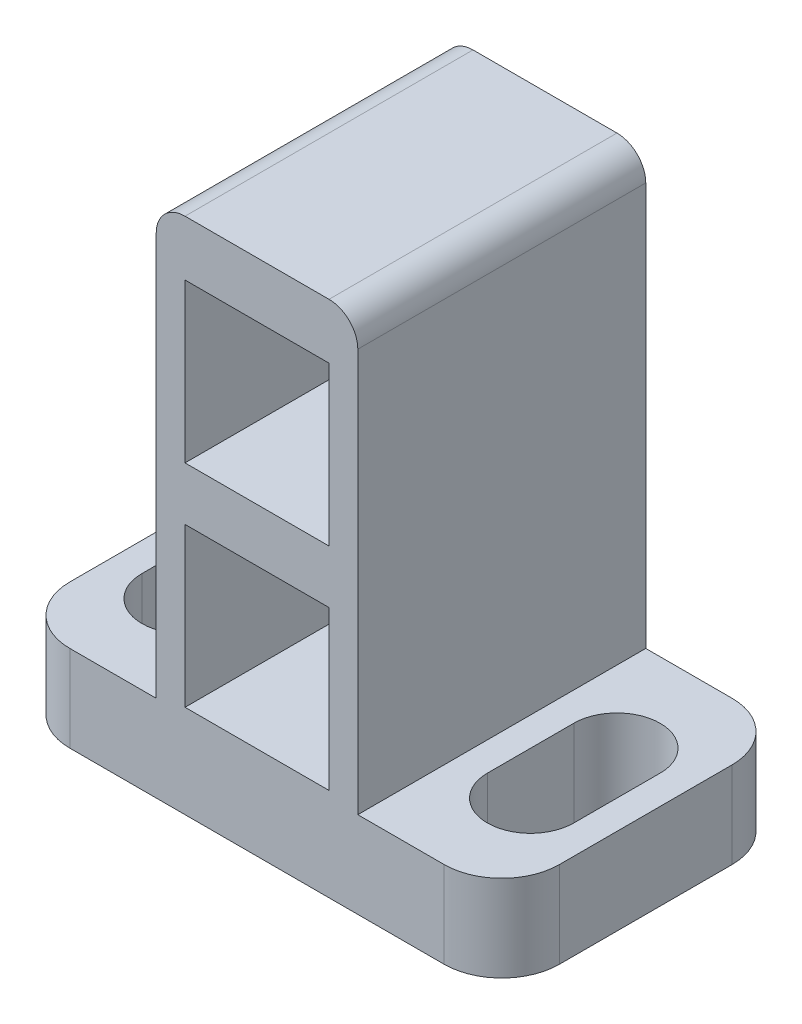
ISO-10303-21;
HEADER;
FILE_DESCRIPTION(('STEP AP214'),'2;1');
FILE_NAME('part.step','',(''),(''),'','','');
FILE_SCHEMA(('AUTOMOTIVE_DESIGN { 1 0 10303 214 1 1 1 1 }'));
ENDSEC;
DATA;
#1=APPLICATION_CONTEXT('core data for automotive mechanical design processes');
#2=APPLICATION_PROTOCOL_DEFINITION('international standard','automotive_design',2000,#1);
#3=PRODUCT_CONTEXT('',#1,'mechanical');
#4=PRODUCT('Part','Part','',(#3));
#5=PRODUCT_RELATED_PRODUCT_CATEGORY('part','',(#4));
#6=PRODUCT_DEFINITION_FORMATION('','',#4);
#7=PRODUCT_DEFINITION_CONTEXT('part definition',#1,'design');
#8=PRODUCT_DEFINITION('design','',#6,#7);
#9=PRODUCT_DEFINITION_SHAPE('','',#8);
#10=(LENGTH_UNIT() NAMED_UNIT(*) SI_UNIT(.MILLI.,.METRE.));
#11=(NAMED_UNIT(*) PLANE_ANGLE_UNIT() SI_UNIT($,.RADIAN.));
#12=(NAMED_UNIT(*) SI_UNIT($,.STERADIAN.) SOLID_ANGLE_UNIT());
#13=UNCERTAINTY_MEASURE_WITH_UNIT(LENGTH_MEASURE(1.E-05),#10,'distance_accuracy_value','');
#14=(GEOMETRIC_REPRESENTATION_CONTEXT(3) GLOBAL_UNCERTAINTY_ASSIGNED_CONTEXT((#13)) GLOBAL_UNIT_ASSIGNED_CONTEXT((#10,
#11,#12)) REPRESENTATION_CONTEXT('',''));
#15=CARTESIAN_POINT('',(0.,0.,0.));
#16=DIRECTION('',(0.,0.,1.));
#17=DIRECTION('',(1.,0.,0.));
#18=AXIS2_PLACEMENT_3D('',#15,#16,#17);
#19=CARTESIAN_POINT('',(-3.5,-9.,8.));
#20=DIRECTION('',(1.,0.,0.));
#21=DIRECTION('',(0.,0.,-1.));
#22=AXIS2_PLACEMENT_3D('',#19,#20,#21);
#23=PLANE('',#22);
#24=DIRECTION('',(0.,-1.,0.));
#25=VECTOR('',#24,1.);
#26=CARTESIAN_POINT('',(-3.5,-9.,8.));
#27=LINE('',#26,#25);
#28=CARTESIAN_POINT('',(-3.5,8.,8.));
#29=VERTEX_POINT('',#28);
#30=CARTESIAN_POINT('',(-3.5,-6.,8.));
#31=VERTEX_POINT('',#30);
#32=EDGE_CURVE('E460',#29,#31,#27,.T.);
#33=ORIENTED_EDGE('',*,*,#32,.F.);
#34=DIRECTION('',(0.,0.,-1.));
#35=VECTOR('',#34,1.);
#36=CARTESIAN_POINT('',(-3.5,8.,8.));
#37=LINE('',#36,#35);
#38=CARTESIAN_POINT('',(-3.5,8.,-2.));
#39=VERTEX_POINT('',#38);
#40=EDGE_CURVE('E12',#29,#39,#37,.T.);
#41=ORIENTED_EDGE('',*,*,#40,.T.);
#42=DIRECTION('',(0.,1.,0.));
#43=VECTOR('',#42,1.);
#44=CARTESIAN_POINT('',(-3.5,9.,-2.));
#45=LINE('',#44,#43);
#46=CARTESIAN_POINT('',(-3.5,-6.,-2.));
#47=VERTEX_POINT('',#46);
#48=EDGE_CURVE('E422',#47,#39,#45,.T.);
#49=ORIENTED_EDGE('',*,*,#48,.F.);
#50=DIRECTION('',(0.,0.,-1.));
#51=VECTOR('',#50,1.);
#52=CARTESIAN_POINT('',(-3.5,-6.,8.));
#53=LINE('',#52,#51);
#54=EDGE_CURVE('E285',#31,#47,#53,.T.);
#55=ORIENTED_EDGE('',*,*,#54,.F.);
#56=EDGE_LOOP('',(#33,#41,#49,#55));
#57=FACE_BOUND('',#56,.T.);
#58=ADVANCED_FACE('F37',(#57),#23,.F.);
#59=CARTESIAN_POINT('',(3.5,-9.,8.));
#60=DIRECTION('',(-1.,0.,0.));
#61=DIRECTION('',(0.,0.,1.));
#62=AXIS2_PLACEMENT_3D('',#59,#60,#61);
#63=PLANE('',#62);
#64=DIRECTION('',(0.,-1.,0.));
#65=VECTOR('',#64,1.);
#66=CARTESIAN_POINT('',(3.5,9.,-2.));
#67=LINE('',#66,#65);
#68=CARTESIAN_POINT('',(3.5,8.,-2.));
#69=VERTEX_POINT('',#68);
#70=CARTESIAN_POINT('',(3.5,-6.,-2.));
#71=VERTEX_POINT('',#70);
#72=EDGE_CURVE('E315',#69,#71,#67,.T.);
#73=ORIENTED_EDGE('',*,*,#72,.F.);
#74=DIRECTION('',(0.,0.,-1.));
#75=VECTOR('',#74,1.);
#76=CARTESIAN_POINT('',(3.5,8.,8.));
#77=LINE('',#76,#75);
#78=CARTESIAN_POINT('',(3.5,8.,8.));
#79=VERTEX_POINT('',#78);
#80=EDGE_CURVE('E60',#69,#79,#77,.F.);
#81=ORIENTED_EDGE('',*,*,#80,.T.);
#82=DIRECTION('',(0.,1.,0.));
#83=VECTOR('',#82,1.);
#84=CARTESIAN_POINT('',(3.5,-9.,8.));
#85=LINE('',#84,#83);
#86=CARTESIAN_POINT('',(3.5,-6.,8.));
#87=VERTEX_POINT('',#86);
#88=EDGE_CURVE('E327',#87,#79,#85,.T.);
#89=ORIENTED_EDGE('',*,*,#88,.F.);
#90=DIRECTION('',(0.,0.,-1.));
#91=VECTOR('',#90,1.);
#92=CARTESIAN_POINT('',(3.5,-6.,8.));
#93=LINE('',#92,#91);
#94=EDGE_CURVE('E336',#87,#71,#93,.T.);
#95=ORIENTED_EDGE('',*,*,#94,.T.);
#96=EDGE_LOOP('',(#73,#81,#89,#95));
#97=FACE_BOUND('',#96,.T.);
#98=ADVANCED_FACE('F522',(#97),#63,.F.);
#99=CARTESIAN_POINT('',(-3.5,9.,8.));
#100=DIRECTION('',(0.,-1.,0.));
#101=DIRECTION('',(0.,0.,-1.));
#102=AXIS2_PLACEMENT_3D('',#99,#100,#101);
#103=PLANE('',#102);
#104=DIRECTION('',(-1.,0.,0.));
#105=VECTOR('',#104,1.);
#106=CARTESIAN_POINT('',(-3.5,9.,8.));
#107=LINE('',#106,#105);
#108=CARTESIAN_POINT('',(2.5,9.,8.));
#109=VERTEX_POINT('',#108);
#110=CARTESIAN_POINT('',(-2.5,9.,8.));
#111=VERTEX_POINT('',#110);
#112=EDGE_CURVE('E330',#109,#111,#107,.T.);
#113=ORIENTED_EDGE('',*,*,#112,.F.);
#114=DIRECTION('',(0.,0.,-1.));
#115=VECTOR('',#114,1.);
#116=CARTESIAN_POINT('',(2.5,9.,8.));
#117=LINE('',#116,#115);
#118=CARTESIAN_POINT('',(2.5,9.,-2.));
#119=VERTEX_POINT('',#118);
#120=EDGE_CURVE('E311',#109,#119,#117,.T.);
#121=ORIENTED_EDGE('',*,*,#120,.T.);
#122=DIRECTION('',(1.,0.,0.));
#123=VECTOR('',#122,1.);
#124=CARTESIAN_POINT('',(-3.5,9.,-2.));
#125=LINE('',#124,#123);
#126=CARTESIAN_POINT('',(-2.5,9.,-2.));
#127=VERTEX_POINT('',#126);
#128=EDGE_CURVE('E319',#127,#119,#125,.T.);
#129=ORIENTED_EDGE('',*,*,#128,.F.);
#130=DIRECTION('',(0.,0.,-1.));
#131=VECTOR('',#130,1.);
#132=CARTESIAN_POINT('',(-2.5,9.,8.));
#133=LINE('',#132,#131);
#134=EDGE_CURVE('E309',#127,#111,#133,.F.);
#135=ORIENTED_EDGE('',*,*,#134,.T.);
#136=EDGE_LOOP('',(#113,#121,#129,#135));
#137=FACE_BOUND('',#136,.T.);
#138=ADVANCED_FACE('F472',(#137),#103,.F.);
#139=CARTESIAN_POINT('',(-3.5,-9.,8.));
#140=DIRECTION('',(0.,1.,0.));
#141=DIRECTION('',(0.,0.,1.));
#142=AXIS2_PLACEMENT_3D('',#139,#140,#141);
#143=PLANE('',#142);
#144=DIRECTION('',(0.,0.,1.));
#145=VECTOR('',#144,1.);
#146=CARTESIAN_POINT('',(-8.5,-9.,8.));
#147=LINE('',#146,#145);
#148=CARTESIAN_POINT('',(-8.5,-9.,0.));
#149=VERTEX_POINT('',#148);
#150=CARTESIAN_POINT('',(-8.5,-9.,6.));
#151=VERTEX_POINT('',#150);
#152=EDGE_CURVE('E276',#149,#151,#147,.T.);
#153=ORIENTED_EDGE('',*,*,#152,.F.);
#154=CARTESIAN_POINT('',(-6.5,-9.,0.));
#155=DIRECTION('',(0.,1.,0.));
#156=DIRECTION('',(0.,0.,1.));
#157=AXIS2_PLACEMENT_3D('',#154,#155,#156);
#158=CIRCLE('',#157,2.);
#159=CARTESIAN_POINT('',(-6.5,-9.,-2.));
#160=VERTEX_POINT('',#159);
#161=EDGE_CURVE('E487',#149,#160,#158,.F.);
#162=ORIENTED_EDGE('',*,*,#161,.T.);
#163=DIRECTION('',(-1.,0.,0.));
#164=VECTOR('',#163,1.);
#165=CARTESIAN_POINT('',(-3.5,-9.,-2.));
#166=LINE('',#165,#164);
#167=CARTESIAN_POINT('',(6.5,-9.,-2.));
#168=VERTEX_POINT('',#167);
#169=EDGE_CURVE('E318',#168,#160,#166,.T.);
#170=ORIENTED_EDGE('',*,*,#169,.F.);
#171=CARTESIAN_POINT('',(6.5,-9.,0.));
#172=DIRECTION('',(0.,1.,0.));
#173=DIRECTION('',(0.,0.,1.));
#174=AXIS2_PLACEMENT_3D('',#171,#172,#173);
#175=CIRCLE('',#174,2.);
#176=CARTESIAN_POINT('',(8.5,-9.,0.));
#177=VERTEX_POINT('',#176);
#178=EDGE_CURVE('E508',#168,#177,#175,.F.);
#179=ORIENTED_EDGE('',*,*,#178,.T.);
#180=DIRECTION('',(0.,0.,1.));
#181=VECTOR('',#180,1.);
#182=CARTESIAN_POINT('',(8.5,-9.,8.));
#183=LINE('',#182,#181);
#184=CARTESIAN_POINT('',(8.5,-9.,6.));
#185=VERTEX_POINT('',#184);
#186=EDGE_CURVE('E341',#177,#185,#183,.T.);
#187=ORIENTED_EDGE('',*,*,#186,.T.);
#188=CARTESIAN_POINT('',(6.5,-9.,6.));
#189=DIRECTION('',(0.,1.,0.));
#190=DIRECTION('',(0.,0.,1.));
#191=AXIS2_PLACEMENT_3D('',#188,#189,#190);
#192=CIRCLE('',#191,2.);
#193=CARTESIAN_POINT('',(6.5,-9.,8.));
#194=VERTEX_POINT('',#193);
#195=EDGE_CURVE('E457',#185,#194,#192,.F.);
#196=ORIENTED_EDGE('',*,*,#195,.T.);
#197=DIRECTION('',(1.,0.,0.));
#198=VECTOR('',#197,1.);
#199=CARTESIAN_POINT('',(-3.5,-9.,8.));
#200=LINE('',#199,#198);
#201=CARTESIAN_POINT('',(-6.5,-9.,8.));
#202=VERTEX_POINT('',#201);
#203=EDGE_CURVE('E335',#202,#194,#200,.T.);
#204=ORIENTED_EDGE('',*,*,#203,.F.);
#205=CARTESIAN_POINT('',(-6.5,-9.,6.));
#206=DIRECTION('',(0.,1.,0.));
#207=DIRECTION('',(0.,0.,1.));
#208=AXIS2_PLACEMENT_3D('',#205,#206,#207);
#209=CIRCLE('',#208,2.);
#210=EDGE_CURVE('E448',#202,#151,#209,.F.);
#211=ORIENTED_EDGE('',*,*,#210,.T.);
#212=EDGE_LOOP('',(#153,#162,#170,#179,#187,#196,#204,#211));
#213=FACE_BOUND('',#212,.T.);
#214=CARTESIAN_POINT('',(6.,-9.,4.5));
#215=DIRECTION('',(0.,-1.,0.));
#216=DIRECTION('',(0.,0.,-1.));
#217=AXIS2_PLACEMENT_3D('',#214,#215,#216);
#218=CIRCLE('',#217,1.5);
#219=CARTESIAN_POINT('',(7.5,-9.,4.5));
#220=VERTEX_POINT('',#219);
#221=CARTESIAN_POINT('',(4.5,-9.,4.5));
#222=VERTEX_POINT('',#221);
#223=EDGE_CURVE('E431',#220,#222,#218,.T.);
#224=ORIENTED_EDGE('',*,*,#223,.F.);
#225=DIRECTION('',(0.,0.,1.));
#226=VECTOR('',#225,1.);
#227=CARTESIAN_POINT('',(7.5,-9.,4.5));
#228=LINE('',#227,#226);
#229=CARTESIAN_POINT('',(7.5,-9.,1.5));
#230=VERTEX_POINT('',#229);
#231=EDGE_CURVE('E933',#230,#220,#228,.T.);
#232=ORIENTED_EDGE('',*,*,#231,.F.);
#233=CARTESIAN_POINT('',(6.,-9.,1.5));
#234=DIRECTION('',(0.,-1.,0.));
#235=DIRECTION('',(0.,0.,-1.));
#236=AXIS2_PLACEMENT_3D('',#233,#234,#235);
#237=CIRCLE('',#236,1.5);
#238=CARTESIAN_POINT('',(4.5,-9.,1.5));
#239=VERTEX_POINT('',#238);
#240=EDGE_CURVE('E931',#239,#230,#237,.T.);
#241=ORIENTED_EDGE('',*,*,#240,.F.);
#242=DIRECTION('',(0.,0.,-1.));
#243=VECTOR('',#242,1.);
#244=CARTESIAN_POINT('',(4.5,-9.,4.5));
#245=LINE('',#244,#243);
#246=EDGE_CURVE('E435',#222,#239,#245,.T.);
#247=ORIENTED_EDGE('',*,*,#246,.F.);
#248=EDGE_LOOP('',(#224,#232,#241,#247));
#249=FACE_BOUND('',#248,.T.);
#250=DIRECTION('',(0.,0.,1.));
#251=VECTOR('',#250,1.);
#252=CARTESIAN_POINT('',(-7.5,-9.,4.5));
#253=LINE('',#252,#251);
#254=CARTESIAN_POINT('',(-7.5,-9.,1.5));
#255=VERTEX_POINT('',#254);
#256=CARTESIAN_POINT('',(-7.5,-9.,4.5));
#257=VERTEX_POINT('',#256);
#258=EDGE_CURVE('E270',#255,#257,#253,.T.);
#259=ORIENTED_EDGE('',*,*,#258,.T.);
#260=CARTESIAN_POINT('',(-6.,-9.,4.5));
#261=DIRECTION('',(0.,1.,0.));
#262=DIRECTION('',(0.,0.,-1.));
#263=AXIS2_PLACEMENT_3D('',#260,#261,#262);
#264=CIRCLE('',#263,1.5);
#265=CARTESIAN_POINT('',(-4.5,-9.,4.5));
#266=VERTEX_POINT('',#265);
#267=EDGE_CURVE('E256',#257,#266,#264,.T.);
#268=ORIENTED_EDGE('',*,*,#267,.T.);
#269=DIRECTION('',(0.,0.,-1.));
#270=VECTOR('',#269,1.);
#271=CARTESIAN_POINT('',(-4.5,-9.,4.5));
#272=LINE('',#271,#270);
#273=CARTESIAN_POINT('',(-4.5,-9.,1.5));
#274=VERTEX_POINT('',#273);
#275=EDGE_CURVE('E261',#266,#274,#272,.T.);
#276=ORIENTED_EDGE('',*,*,#275,.T.);
#277=CARTESIAN_POINT('',(-6.,-9.,1.5));
#278=DIRECTION('',(0.,1.,0.));
#279=DIRECTION('',(0.,0.,-1.));
#280=AXIS2_PLACEMENT_3D('',#277,#278,#279);
#281=CIRCLE('',#280,1.5);
#282=EDGE_CURVE('E264',#274,#255,#281,.T.);
#283=ORIENTED_EDGE('',*,*,#282,.T.);
#284=EDGE_LOOP('',(#259,#268,#276,#283));
#285=FACE_BOUND('',#284,.T.);
#286=ADVANCED_FACE('F454',(#213,#249,#285),#143,.F.);
#287=CARTESIAN_POINT('',(0.,0.,8.));
#288=DIRECTION('',(0.,0.,-1.));
#289=DIRECTION('',(-1.,0.,0.));
#290=AXIS2_PLACEMENT_3D('',#287,#288,#289);
#291=PLANE('',#290);
#292=DIRECTION('',(-1.,0.,0.));
#293=VECTOR('',#292,1.);
#294=CARTESIAN_POINT('',(-2.5,-0.270000000000002,8.));
#295=LINE('',#294,#293);
#296=CARTESIAN_POINT('',(2.5,-0.270000000000002,8.));
#297=VERTEX_POINT('',#296);
#298=CARTESIAN_POINT('',(-2.5,-0.270000000000002,8.));
#299=VERTEX_POINT('',#298);
#300=EDGE_CURVE('E377',#297,#299,#295,.T.);
#301=ORIENTED_EDGE('',*,*,#300,.F.);
#302=DIRECTION('',(0.,1.,0.));
#303=VECTOR('',#302,1.);
#304=CARTESIAN_POINT('',(2.5,-5.77,8.));
#305=LINE('',#304,#303);
#306=CARTESIAN_POINT('',(2.5,-5.77,8.));
#307=VERTEX_POINT('',#306);
#308=EDGE_CURVE('E365',#307,#297,#305,.T.);
#309=ORIENTED_EDGE('',*,*,#308,.F.);
#310=DIRECTION('',(1.,0.,0.));
#311=VECTOR('',#310,1.);
#312=CARTESIAN_POINT('',(-2.5,-5.77,8.));
#313=LINE('',#312,#311);
#314=CARTESIAN_POINT('',(-2.5,-5.77,8.));
#315=VERTEX_POINT('',#314);
#316=EDGE_CURVE('E383',#315,#307,#313,.T.);
#317=ORIENTED_EDGE('',*,*,#316,.F.);
#318=DIRECTION('',(0.,-1.,0.));
#319=VECTOR('',#318,1.);
#320=CARTESIAN_POINT('',(-2.5,-5.77,8.));
#321=LINE('',#320,#319);
#322=EDGE_CURVE('E380',#299,#315,#321,.T.);
#323=ORIENTED_EDGE('',*,*,#322,.F.);
#324=EDGE_LOOP('',(#301,#309,#317,#323));
#325=FACE_BOUND('',#324,.T.);
#326=DIRECTION('',(-1.,0.,0.));
#327=VECTOR('',#326,1.);
#328=CARTESIAN_POINT('',(-2.5,7.08,8.));
#329=LINE('',#328,#327);
#330=CARTESIAN_POINT('',(2.5,7.08,8.));
#331=VERTEX_POINT('',#330);
#332=CARTESIAN_POINT('',(-2.5,7.08,8.));
#333=VERTEX_POINT('',#332);
#334=EDGE_CURVE('E405',#331,#333,#329,.T.);
#335=ORIENTED_EDGE('',*,*,#334,.F.);
#336=DIRECTION('',(0.,1.,0.));
#337=VECTOR('',#336,1.);
#338=CARTESIAN_POINT('',(2.5,1.58,8.));
#339=LINE('',#338,#337);
#340=CARTESIAN_POINT('',(2.5,1.58,8.));
#341=VERTEX_POINT('',#340);
#342=EDGE_CURVE('E395',#341,#331,#339,.T.);
#343=ORIENTED_EDGE('',*,*,#342,.F.);
#344=DIRECTION('',(1.,0.,0.));
#345=VECTOR('',#344,1.);
#346=CARTESIAN_POINT('',(-2.5,1.58,8.));
#347=LINE('',#346,#345);
#348=CARTESIAN_POINT('',(-2.5,1.58,8.));
#349=VERTEX_POINT('',#348);
#350=EDGE_CURVE('E411',#349,#341,#347,.T.);
#351=ORIENTED_EDGE('',*,*,#350,.F.);
#352=DIRECTION('',(0.,-1.,0.));
#353=VECTOR('',#352,1.);
#354=CARTESIAN_POINT('',(-2.5,1.58,8.));
#355=LINE('',#354,#353);
#356=EDGE_CURVE('E408',#333,#349,#355,.T.);
#357=ORIENTED_EDGE('',*,*,#356,.F.);
#358=EDGE_LOOP('',(#335,#343,#351,#357));
#359=FACE_BOUND('',#358,.T.);
#360=ORIENTED_EDGE('',*,*,#88,.T.);
#361=CARTESIAN_POINT('',(2.5,8.,8.));
#362=DIRECTION('',(0.,0.,-1.));
#363=DIRECTION('',(-1.,0.,0.));
#364=AXIS2_PLACEMENT_3D('',#361,#362,#363);
#365=CIRCLE('',#364,1.);
#366=EDGE_CURVE('E45',#79,#109,#365,.F.);
#367=ORIENTED_EDGE('',*,*,#366,.T.);
#368=ORIENTED_EDGE('',*,*,#112,.T.);
#369=CARTESIAN_POINT('',(-2.5,8.,8.));
#370=DIRECTION('',(0.,0.,-1.));
#371=DIRECTION('',(-1.,0.,0.));
#372=AXIS2_PLACEMENT_3D('',#369,#370,#371);
#373=CIRCLE('',#372,1.);
#374=EDGE_CURVE('E52',#111,#29,#373,.F.);
#375=ORIENTED_EDGE('',*,*,#374,.T.);
#376=ORIENTED_EDGE('',*,*,#32,.T.);
#377=DIRECTION('',(1.,0.,0.));
#378=VECTOR('',#377,1.);
#379=CARTESIAN_POINT('',(-3.5,-6.,8.));
#380=LINE('',#379,#378);
#381=CARTESIAN_POINT('',(-6.5,-6.,8.));
#382=VERTEX_POINT('',#381);
#383=EDGE_CURVE('E289',#382,#31,#380,.T.);
#384=ORIENTED_EDGE('',*,*,#383,.F.);
#385=DIRECTION('',(0.,-1.,0.));
#386=VECTOR('',#385,1.);
#387=CARTESIAN_POINT('',(-6.5,0.,8.));
#388=LINE('',#387,#386);
#389=EDGE_CURVE('E306',#382,#202,#388,.T.);
#390=ORIENTED_EDGE('',*,*,#389,.T.);
#391=ORIENTED_EDGE('',*,*,#203,.T.);
#392=DIRECTION('',(0.,-1.,0.));
#393=VECTOR('',#392,1.);
#394=CARTESIAN_POINT('',(6.5,-6.,8.));
#395=LINE('',#394,#393);
#396=CARTESIAN_POINT('',(6.5,-6.,8.));
#397=VERTEX_POINT('',#396);
#398=EDGE_CURVE('E427',#194,#397,#395,.F.);
#399=ORIENTED_EDGE('',*,*,#398,.T.);
#400=DIRECTION('',(-1.,0.,0.));
#401=VECTOR('',#400,1.);
#402=CARTESIAN_POINT('',(3.5,-6.,8.));
#403=LINE('',#402,#401);
#404=EDGE_CURVE('E351',#397,#87,#403,.T.);
#405=ORIENTED_EDGE('',*,*,#404,.T.);
#406=EDGE_LOOP('',(#360,#367,#368,#375,#376,#384,#390,#391,#399,#405));
#407=FACE_BOUND('',#406,.T.);
#408=ADVANCED_FACE('F450',(#325,#359,#407),#291,.F.);
#409=CARTESIAN_POINT('',(0.,0.,-2.));
#410=DIRECTION('',(0.,0.,1.));
#411=DIRECTION('',(1.,0.,0.));
#412=AXIS2_PLACEMENT_3D('',#409,#410,#411);
#413=PLANE('',#412);
#414=CARTESIAN_POINT('',(0.,-3.02,-2.));
#415=DIRECTION('',(0.,0.,1.));
#416=DIRECTION('',(1.,0.,0.));
#417=AXIS2_PLACEMENT_3D('',#414,#415,#416);
#418=CIRCLE('',#417,1.);
#419=CARTESIAN_POINT('',(1.,-3.02,-2.));
#420=VERTEX_POINT('',#419);
#421=EDGE_CURVE('E355',#420,#420,#418,.T.);
#422=ORIENTED_EDGE('',*,*,#421,.T.);
#423=EDGE_LOOP('',(#422));
#424=FACE_BOUND('',#423,.T.);
#425=CARTESIAN_POINT('',(0.,4.33,-2.));
#426=DIRECTION('',(0.,0.,1.));
#427=DIRECTION('',(1.,0.,0.));
#428=AXIS2_PLACEMENT_3D('',#425,#426,#427);
#429=CIRCLE('',#428,1.);
#430=CARTESIAN_POINT('',(1.,4.33,-2.));
#431=VERTEX_POINT('',#430);
#432=EDGE_CURVE('E362',#431,#431,#429,.T.);
#433=ORIENTED_EDGE('',*,*,#432,.T.);
#434=EDGE_LOOP('',(#433));
#435=FACE_BOUND('',#434,.T.);
#436=ORIENTED_EDGE('',*,*,#128,.T.);
#437=CARTESIAN_POINT('',(2.5,8.,-2.));
#438=DIRECTION('',(0.,0.,1.));
#439=DIRECTION('',(1.,0.,0.));
#440=AXIS2_PLACEMENT_3D('',#437,#438,#439);
#441=CIRCLE('',#440,1.);
#442=EDGE_CURVE('E477',#119,#69,#441,.F.);
#443=ORIENTED_EDGE('',*,*,#442,.T.);
#444=ORIENTED_EDGE('',*,*,#72,.T.);
#445=DIRECTION('',(1.,0.,0.));
#446=VECTOR('',#445,1.);
#447=CARTESIAN_POINT('',(3.5,-6.,-2.));
#448=LINE('',#447,#446);
#449=CARTESIAN_POINT('',(6.5,-6.,-2.));
#450=VERTEX_POINT('',#449);
#451=EDGE_CURVE('E340',#71,#450,#448,.T.);
#452=ORIENTED_EDGE('',*,*,#451,.T.);
#453=DIRECTION('',(0.,-1.,0.));
#454=VECTOR('',#453,1.);
#455=CARTESIAN_POINT('',(6.5,-9.,-2.));
#456=LINE('',#455,#454);
#457=EDGE_CURVE('E459',#450,#168,#456,.T.);
#458=ORIENTED_EDGE('',*,*,#457,.T.);
#459=ORIENTED_EDGE('',*,*,#169,.T.);
#460=DIRECTION('',(0.,-1.,0.));
#461=VECTOR('',#460,1.);
#462=CARTESIAN_POINT('',(-6.5,0.,-2.));
#463=LINE('',#462,#461);
#464=CARTESIAN_POINT('',(-6.5,-6.,-2.));
#465=VERTEX_POINT('',#464);
#466=EDGE_CURVE('E300',#160,#465,#463,.F.);
#467=ORIENTED_EDGE('',*,*,#466,.T.);
#468=DIRECTION('',(-1.,0.,0.));
#469=VECTOR('',#468,1.);
#470=CARTESIAN_POINT('',(-3.5,-6.,-2.));
#471=LINE('',#470,#469);
#472=EDGE_CURVE('E429',#47,#465,#471,.T.);
#473=ORIENTED_EDGE('',*,*,#472,.F.);
#474=ORIENTED_EDGE('',*,*,#48,.T.);
#475=CARTESIAN_POINT('',(-2.5,8.,-2.));
#476=DIRECTION('',(0.,0.,1.));
#477=DIRECTION('',(1.,0.,0.));
#478=AXIS2_PLACEMENT_3D('',#475,#476,#477);
#479=CIRCLE('',#478,1.);
#480=EDGE_CURVE('E314',#39,#127,#479,.F.);
#481=ORIENTED_EDGE('',*,*,#480,.T.);
#482=EDGE_LOOP('',(#436,#443,#444,#452,#458,#459,#467,#473,#474,#481));
#483=FACE_BOUND('',#482,.T.);
#484=ADVANCED_FACE('F479',(#424,#435,#483),#413,.F.);
#485=CARTESIAN_POINT('',(2.5,1.58,-9.43303437365926));
#486=DIRECTION('',(1.,0.,0.));
#487=DIRECTION('',(0.,0.,-1.));
#488=AXIS2_PLACEMENT_3D('',#485,#486,#487);
#489=PLANE('',#488);
#490=DIRECTION('',(0.,-1.,0.));
#491=VECTOR('',#490,1.);
#492=CARTESIAN_POINT('',(2.5,1.58,0.));
#493=LINE('',#492,#491);
#494=CARTESIAN_POINT('',(2.5,7.08,0.));
#495=VERTEX_POINT('',#494);
#496=CARTESIAN_POINT('',(2.5,1.58,0.));
#497=VERTEX_POINT('',#496);
#498=EDGE_CURVE('E401',#495,#497,#493,.T.);
#499=ORIENTED_EDGE('',*,*,#498,.T.);
#500=DIRECTION('',(0.,0.,1.));
#501=VECTOR('',#500,1.);
#502=CARTESIAN_POINT('',(2.5,1.58,-9.43303437365926));
#503=LINE('',#502,#501);
#504=EDGE_CURVE('E399',#497,#341,#503,.T.);
#505=ORIENTED_EDGE('',*,*,#504,.T.);
#506=ORIENTED_EDGE('',*,*,#342,.T.);
#507=DIRECTION('',(0.,0.,1.));
#508=VECTOR('',#507,1.);
#509=CARTESIAN_POINT('',(2.5,7.08,-9.43303437365926));
#510=LINE('',#509,#508);
#511=EDGE_CURVE('E414',#495,#331,#510,.T.);
#512=ORIENTED_EDGE('',*,*,#511,.F.);
#513=EDGE_LOOP('',(#499,#505,#506,#512));
#514=FACE_BOUND('',#513,.T.);
#515=ADVANCED_FACE('F563',(#514),#489,.F.);
#516=CARTESIAN_POINT('',(-2.5,1.58,-9.43303437365926));
#517=DIRECTION('',(0.,-1.,0.));
#518=DIRECTION('',(0.,0.,-1.));
#519=AXIS2_PLACEMENT_3D('',#516,#517,#518);
#520=PLANE('',#519);
#521=DIRECTION('',(-1.,0.,0.));
#522=VECTOR('',#521,1.);
#523=CARTESIAN_POINT('',(-2.5,1.58,0.));
#524=LINE('',#523,#522);
#525=CARTESIAN_POINT('',(-2.5,1.58,0.));
#526=VERTEX_POINT('',#525);
#527=EDGE_CURVE('E398',#497,#526,#524,.T.);
#528=ORIENTED_EDGE('',*,*,#527,.T.);
#529=DIRECTION('',(0.,0.,1.));
#530=VECTOR('',#529,1.);
#531=CARTESIAN_POINT('',(-2.5,1.58,-9.43303437365926));
#532=LINE('',#531,#530);
#533=EDGE_CURVE('E416',#526,#349,#532,.T.);
#534=ORIENTED_EDGE('',*,*,#533,.T.);
#535=ORIENTED_EDGE('',*,*,#350,.T.);
#536=ORIENTED_EDGE('',*,*,#504,.F.);
#537=EDGE_LOOP('',(#528,#534,#535,#536));
#538=FACE_BOUND('',#537,.T.);
#539=ADVANCED_FACE('F838',(#538),#520,.F.);
#540=CARTESIAN_POINT('',(-2.5,1.58,-9.43303437365926));
#541=DIRECTION('',(-1.,0.,0.));
#542=DIRECTION('',(0.,0.,1.));
#543=AXIS2_PLACEMENT_3D('',#540,#541,#542);
#544=PLANE('',#543);
#545=DIRECTION('',(0.,1.,0.));
#546=VECTOR('',#545,1.);
#547=CARTESIAN_POINT('',(-2.5,1.58,0.));
#548=LINE('',#547,#546);
#549=CARTESIAN_POINT('',(-2.5,7.08,0.));
#550=VERTEX_POINT('',#549);
#551=EDGE_CURVE('E396',#526,#550,#548,.T.);
#552=ORIENTED_EDGE('',*,*,#551,.T.);
#553=DIRECTION('',(0.,0.,1.));
#554=VECTOR('',#553,1.);
#555=CARTESIAN_POINT('',(-2.5,7.08,-9.43303437365926));
#556=LINE('',#555,#554);
#557=EDGE_CURVE('E418',#550,#333,#556,.T.);
#558=ORIENTED_EDGE('',*,*,#557,.T.);
#559=ORIENTED_EDGE('',*,*,#356,.T.);
#560=ORIENTED_EDGE('',*,*,#533,.F.);
#561=EDGE_LOOP('',(#552,#558,#559,#560));
#562=FACE_BOUND('',#561,.T.);
#563=ADVANCED_FACE('F828',(#562),#544,.F.);
#564=CARTESIAN_POINT('',(-2.5,7.08,-9.43303437365926));
#565=DIRECTION('',(0.,1.,0.));
#566=DIRECTION('',(0.,0.,1.));
#567=AXIS2_PLACEMENT_3D('',#564,#565,#566);
#568=PLANE('',#567);
#569=DIRECTION('',(1.,0.,0.));
#570=VECTOR('',#569,1.);
#571=CARTESIAN_POINT('',(-2.5,7.08,0.));
#572=LINE('',#571,#570);
#573=EDGE_CURVE('E403',#550,#495,#572,.T.);
#574=ORIENTED_EDGE('',*,*,#573,.T.);
#575=ORIENTED_EDGE('',*,*,#511,.T.);
#576=ORIENTED_EDGE('',*,*,#334,.T.);
#577=ORIENTED_EDGE('',*,*,#557,.F.);
#578=EDGE_LOOP('',(#574,#575,#576,#577));
#579=FACE_BOUND('',#578,.T.);
#580=ADVANCED_FACE('F782',(#579),#568,.F.);
#581=CARTESIAN_POINT('',(0.,0.,0.));
#582=DIRECTION('',(0.,0.,1.));
#583=DIRECTION('',(1.,0.,0.));
#584=AXIS2_PLACEMENT_3D('',#581,#582,#583);
#585=PLANE('',#584);
#586=CARTESIAN_POINT('',(0.,4.33,0.));
#587=DIRECTION('',(0.,0.,1.));
#588=DIRECTION('',(1.,0.,0.));
#589=AXIS2_PLACEMENT_3D('',#586,#587,#588);
#590=CIRCLE('',#589,1.);
#591=CARTESIAN_POINT('',(1.,4.33,0.));
#592=VERTEX_POINT('',#591);
#593=EDGE_CURVE('E358',#592,#592,#590,.T.);
#594=ORIENTED_EDGE('',*,*,#593,.F.);
#595=EDGE_LOOP('',(#594));
#596=FACE_BOUND('',#595,.T.);
#597=ORIENTED_EDGE('',*,*,#498,.F.);
#598=ORIENTED_EDGE('',*,*,#573,.F.);
#599=ORIENTED_EDGE('',*,*,#551,.F.);
#600=ORIENTED_EDGE('',*,*,#527,.F.);
#601=EDGE_LOOP('',(#597,#598,#599,#600));
#602=FACE_BOUND('',#601,.T.);
#603=ADVANCED_FACE('F776',(#596,#602),#585,.T.);
#604=CARTESIAN_POINT('',(2.5,-5.77,-9.43303437365926));
#605=DIRECTION('',(1.,0.,0.));
#606=DIRECTION('',(0.,0.,-1.));
#607=AXIS2_PLACEMENT_3D('',#604,#605,#606);
#608=PLANE('',#607);
#609=DIRECTION('',(0.,-1.,0.));
#610=VECTOR('',#609,1.);
#611=CARTESIAN_POINT('',(2.5,-5.77,0.));
#612=LINE('',#611,#610);
#613=CARTESIAN_POINT('',(2.5,-0.270000000000002,0.));
#614=VERTEX_POINT('',#613);
#615=CARTESIAN_POINT('',(2.5,-5.77,0.));
#616=VERTEX_POINT('',#615);
#617=EDGE_CURVE('E373',#614,#616,#612,.T.);
#618=ORIENTED_EDGE('',*,*,#617,.T.);
#619=DIRECTION('',(0.,0.,1.));
#620=VECTOR('',#619,1.);
#621=CARTESIAN_POINT('',(2.5,-5.77,-9.43303437365926));
#622=LINE('',#621,#620);
#623=EDGE_CURVE('E371',#616,#307,#622,.T.);
#624=ORIENTED_EDGE('',*,*,#623,.T.);
#625=ORIENTED_EDGE('',*,*,#308,.T.);
#626=DIRECTION('',(0.,0.,1.));
#627=VECTOR('',#626,1.);
#628=CARTESIAN_POINT('',(2.5,-0.270000000000002,-9.43303437365926));
#629=LINE('',#628,#627);
#630=EDGE_CURVE('E386',#614,#297,#629,.T.);
#631=ORIENTED_EDGE('',*,*,#630,.F.);
#632=EDGE_LOOP('',(#618,#624,#625,#631));
#633=FACE_BOUND('',#632,.T.);
#634=ADVANCED_FACE('F781',(#633),#608,.F.);
#635=CARTESIAN_POINT('',(-2.5,-5.77,-9.43303437365926));
#636=DIRECTION('',(0.,-1.,0.));
#637=DIRECTION('',(0.,0.,-1.));
#638=AXIS2_PLACEMENT_3D('',#635,#636,#637);
#639=PLANE('',#638);
#640=DIRECTION('',(-1.,0.,0.));
#641=VECTOR('',#640,1.);
#642=CARTESIAN_POINT('',(-2.5,-5.77,0.));
#643=LINE('',#642,#641);
#644=CARTESIAN_POINT('',(-2.5,-5.77,0.));
#645=VERTEX_POINT('',#644);
#646=EDGE_CURVE('E370',#616,#645,#643,.T.);
#647=ORIENTED_EDGE('',*,*,#646,.T.);
#648=DIRECTION('',(0.,0.,1.));
#649=VECTOR('',#648,1.);
#650=CARTESIAN_POINT('',(-2.5,-5.77,-9.43303437365926));
#651=LINE('',#650,#649);
#652=EDGE_CURVE('E388',#645,#315,#651,.T.);
#653=ORIENTED_EDGE('',*,*,#652,.T.);
#654=ORIENTED_EDGE('',*,*,#316,.T.);
#655=ORIENTED_EDGE('',*,*,#623,.F.);
#656=EDGE_LOOP('',(#647,#653,#654,#655));
#657=FACE_BOUND('',#656,.T.);
#658=ADVANCED_FACE('F804',(#657),#639,.F.);
#659=CARTESIAN_POINT('',(-2.5,-5.77,-9.43303437365926));
#660=DIRECTION('',(-1.,0.,0.));
#661=DIRECTION('',(0.,0.,1.));
#662=AXIS2_PLACEMENT_3D('',#659,#660,#661);
#663=PLANE('',#662);
#664=DIRECTION('',(0.,1.,0.));
#665=VECTOR('',#664,1.);
#666=CARTESIAN_POINT('',(-2.5,-5.77,0.));
#667=LINE('',#666,#665);
#668=CARTESIAN_POINT('',(-2.5,-0.270000000000002,0.));
#669=VERTEX_POINT('',#668);
#670=EDGE_CURVE('E368',#645,#669,#667,.T.);
#671=ORIENTED_EDGE('',*,*,#670,.T.);
#672=DIRECTION('',(0.,0.,1.));
#673=VECTOR('',#672,1.);
#674=CARTESIAN_POINT('',(-2.5,-0.270000000000002,-9.43303437365926));
#675=LINE('',#674,#673);
#676=EDGE_CURVE('E390',#669,#299,#675,.T.);
#677=ORIENTED_EDGE('',*,*,#676,.T.);
#678=ORIENTED_EDGE('',*,*,#322,.T.);
#679=ORIENTED_EDGE('',*,*,#652,.F.);
#680=EDGE_LOOP('',(#671,#677,#678,#679));
#681=FACE_BOUND('',#680,.T.);
#682=ADVANCED_FACE('F794',(#681),#663,.F.);
#683=CARTESIAN_POINT('',(-2.5,-0.270000000000002,-9.43303437365926));
#684=DIRECTION('',(0.,1.,0.));
#685=DIRECTION('',(0.,0.,1.));
#686=AXIS2_PLACEMENT_3D('',#683,#684,#685);
#687=PLANE('',#686);
#688=DIRECTION('',(1.,0.,0.));
#689=VECTOR('',#688,1.);
#690=CARTESIAN_POINT('',(-2.5,-0.270000000000002,0.));
#691=LINE('',#690,#689);
#692=EDGE_CURVE('E375',#669,#614,#691,.T.);
#693=ORIENTED_EDGE('',*,*,#692,.T.);
#694=ORIENTED_EDGE('',*,*,#630,.T.);
#695=ORIENTED_EDGE('',*,*,#300,.T.);
#696=ORIENTED_EDGE('',*,*,#676,.F.);
#697=EDGE_LOOP('',(#693,#694,#695,#696));
#698=FACE_BOUND('',#697,.T.);
#699=ADVANCED_FACE('F768',(#698),#687,.F.);
#700=CARTESIAN_POINT('',(0.,0.,0.));
#701=DIRECTION('',(0.,0.,1.));
#702=DIRECTION('',(1.,0.,0.));
#703=AXIS2_PLACEMENT_3D('',#700,#701,#702);
#704=PLANE('',#703);
#705=CARTESIAN_POINT('',(0.,-3.02,0.));
#706=DIRECTION('',(0.,0.,1.));
#707=DIRECTION('',(1.,0.,0.));
#708=AXIS2_PLACEMENT_3D('',#705,#706,#707);
#709=CIRCLE('',#708,1.);
#710=CARTESIAN_POINT('',(1.,-3.02,0.));
#711=VERTEX_POINT('',#710);
#712=EDGE_CURVE('E359',#711,#711,#709,.T.);
#713=ORIENTED_EDGE('',*,*,#712,.F.);
#714=EDGE_LOOP('',(#713));
#715=FACE_BOUND('',#714,.T.);
#716=ORIENTED_EDGE('',*,*,#617,.F.);
#717=ORIENTED_EDGE('',*,*,#692,.F.);
#718=ORIENTED_EDGE('',*,*,#670,.F.);
#719=ORIENTED_EDGE('',*,*,#646,.F.);
#720=EDGE_LOOP('',(#716,#717,#718,#719));
#721=FACE_BOUND('',#720,.T.);
#722=ADVANCED_FACE('F758',(#715,#721),#704,.T.);
#723=CARTESIAN_POINT('',(0.,4.33,-2.));
#724=DIRECTION('',(0.,0.,1.));
#725=DIRECTION('',(1.,0.,0.));
#726=AXIS2_PLACEMENT_3D('',#723,#724,#725);
#727=CYLINDRICAL_SURFACE('',#726,1.);
#728=ORIENTED_EDGE('',*,*,#432,.F.);
#729=EDGE_LOOP('',(#728));
#730=FACE_BOUND('',#729,.T.);
#731=ORIENTED_EDGE('',*,*,#593,.T.);
#732=EDGE_LOOP('',(#731));
#733=FACE_BOUND('',#732,.T.);
#734=ADVANCED_FACE('F748',(#730,#733),#727,.F.);
#735=CARTESIAN_POINT('',(0.,-3.02,-2.));
#736=DIRECTION('',(0.,0.,1.));
#737=DIRECTION('',(1.,0.,0.));
#738=AXIS2_PLACEMENT_3D('',#735,#736,#737);
#739=CYLINDRICAL_SURFACE('',#738,1.);
#740=ORIENTED_EDGE('',*,*,#421,.F.);
#741=EDGE_LOOP('',(#740));
#742=FACE_BOUND('',#741,.T.);
#743=ORIENTED_EDGE('',*,*,#712,.T.);
#744=EDGE_LOOP('',(#743));
#745=FACE_BOUND('',#744,.T.);
#746=ADVANCED_FACE('F705',(#742,#745),#739,.F.);
#747=CARTESIAN_POINT('',(8.5,-6.,8.));
#748=DIRECTION('',(1.,0.,0.));
#749=DIRECTION('',(0.,0.,-1.));
#750=AXIS2_PLACEMENT_3D('',#747,#748,#749);
#751=PLANE('',#750);
#752=ORIENTED_EDGE('',*,*,#186,.F.);
#753=DIRECTION('',(0.,-1.,0.));
#754=VECTOR('',#753,1.);
#755=CARTESIAN_POINT('',(8.5,-6.,0.));
#756=LINE('',#755,#754);
#757=CARTESIAN_POINT('',(8.5,-6.,0.));
#758=VERTEX_POINT('',#757);
#759=EDGE_CURVE('E498',#177,#758,#756,.F.);
#760=ORIENTED_EDGE('',*,*,#759,.T.);
#761=DIRECTION('',(0.,0.,1.));
#762=VECTOR('',#761,1.);
#763=CARTESIAN_POINT('',(8.5,-6.,8.));
#764=LINE('',#763,#762);
#765=CARTESIAN_POINT('',(8.5,-6.,6.));
#766=VERTEX_POINT('',#765);
#767=EDGE_CURVE('E348',#758,#766,#764,.T.);
#768=ORIENTED_EDGE('',*,*,#767,.T.);
#769=DIRECTION('',(0.,-1.,0.));
#770=VECTOR('',#769,1.);
#771=CARTESIAN_POINT('',(8.5,-9.,6.));
#772=LINE('',#771,#770);
#773=EDGE_CURVE('E509',#766,#185,#772,.T.);
#774=ORIENTED_EDGE('',*,*,#773,.T.);
#775=EDGE_LOOP('',(#752,#760,#768,#774));
#776=FACE_BOUND('',#775,.T.);
#777=ADVANCED_FACE('F515',(#776),#751,.T.);
#778=CARTESIAN_POINT('',(0.,-6.,0.));
#779=DIRECTION('',(0.,-1.,0.));
#780=DIRECTION('',(0.,0.,-1.));
#781=AXIS2_PLACEMENT_3D('',#778,#779,#780);
#782=PLANE('',#781);
#783=DIRECTION('',(0.,0.,1.));
#784=VECTOR('',#783,1.);
#785=CARTESIAN_POINT('',(7.5,-6.,4.5));
#786=LINE('',#785,#784);
#787=CARTESIAN_POINT('',(7.5,-6.,1.5));
#788=VERTEX_POINT('',#787);
#789=CARTESIAN_POINT('',(7.5,-6.,4.5));
#790=VERTEX_POINT('',#789);
#791=EDGE_CURVE('E928',#788,#790,#786,.T.);
#792=ORIENTED_EDGE('',*,*,#791,.T.);
#793=CARTESIAN_POINT('',(6.,-6.,4.5));
#794=DIRECTION('',(0.,-1.,0.));
#795=DIRECTION('',(0.,0.,-1.));
#796=AXIS2_PLACEMENT_3D('',#793,#794,#795);
#797=CIRCLE('',#796,1.5);
#798=CARTESIAN_POINT('',(4.5,-6.,4.5));
#799=VERTEX_POINT('',#798);
#800=EDGE_CURVE('E938',#790,#799,#797,.T.);
#801=ORIENTED_EDGE('',*,*,#800,.T.);
#802=DIRECTION('',(0.,0.,-1.));
#803=VECTOR('',#802,1.);
#804=CARTESIAN_POINT('',(4.5,-6.,4.5));
#805=LINE('',#804,#803);
#806=CARTESIAN_POINT('',(4.5,-6.,1.5));
#807=VERTEX_POINT('',#806);
#808=EDGE_CURVE('E925',#799,#807,#805,.T.);
#809=ORIENTED_EDGE('',*,*,#808,.T.);
#810=CARTESIAN_POINT('',(6.,-6.,1.5));
#811=DIRECTION('',(0.,-1.,0.));
#812=DIRECTION('',(0.,0.,-1.));
#813=AXIS2_PLACEMENT_3D('',#810,#811,#812);
#814=CIRCLE('',#813,1.5);
#815=EDGE_CURVE('E942',#807,#788,#814,.T.);
#816=ORIENTED_EDGE('',*,*,#815,.T.);
#817=EDGE_LOOP('',(#792,#801,#809,#816));
#818=FACE_BOUND('',#817,.T.);
#819=ORIENTED_EDGE('',*,*,#767,.F.);
#820=CARTESIAN_POINT('',(6.5,-6.,0.));
#821=DIRECTION('',(0.,-1.,0.));
#822=DIRECTION('',(0.,0.,-1.));
#823=AXIS2_PLACEMENT_3D('',#820,#821,#822);
#824=CIRCLE('',#823,2.);
#825=EDGE_CURVE('E490',#758,#450,#824,.F.);
#826=ORIENTED_EDGE('',*,*,#825,.T.);
#827=ORIENTED_EDGE('',*,*,#451,.F.);
#828=ORIENTED_EDGE('',*,*,#94,.F.);
#829=ORIENTED_EDGE('',*,*,#404,.F.);
#830=CARTESIAN_POINT('',(6.5,-6.,6.));
#831=DIRECTION('',(0.,-1.,0.));
#832=DIRECTION('',(0.,0.,-1.));
#833=AXIS2_PLACEMENT_3D('',#830,#831,#832);
#834=CIRCLE('',#833,2.);
#835=EDGE_CURVE('E492',#397,#766,#834,.F.);
#836=ORIENTED_EDGE('',*,*,#835,.T.);
#837=EDGE_LOOP('',(#819,#826,#827,#828,#829,#836));
#838=FACE_BOUND('',#837,.T.);
#839=ADVANCED_FACE('F517',(#818,#838),#782,.F.);
#840=CARTESIAN_POINT('',(6.,-6.,4.5));
#841=DIRECTION('',(0.,-1.,0.));
#842=DIRECTION('',(0.,0.,-1.));
#843=AXIS2_PLACEMENT_3D('',#840,#841,#842);
#844=CYLINDRICAL_SURFACE('',#843,1.5);
#845=ORIENTED_EDGE('',*,*,#223,.T.);
#846=DIRECTION('',(0.,-1.,0.));
#847=VECTOR('',#846,1.);
#848=CARTESIAN_POINT('',(4.5,-6.,4.5));
#849=LINE('',#848,#847);
#850=EDGE_CURVE('E346',#799,#222,#849,.T.);
#851=ORIENTED_EDGE('',*,*,#850,.F.);
#852=ORIENTED_EDGE('',*,*,#800,.F.);
#853=DIRECTION('',(0.,-1.,0.));
#854=VECTOR('',#853,1.);
#855=CARTESIAN_POINT('',(7.5,-6.,4.5));
#856=LINE('',#855,#854);
#857=EDGE_CURVE('E354',#790,#220,#856,.T.);
#858=ORIENTED_EDGE('',*,*,#857,.T.);
#859=EDGE_LOOP('',(#845,#851,#852,#858));
#860=FACE_BOUND('',#859,.T.);
#861=ADVANCED_FACE('F693',(#860),#844,.F.);
#862=CARTESIAN_POINT('',(7.5,-6.,4.5));
#863=DIRECTION('',(1.,0.,0.));
#864=DIRECTION('',(0.,0.,-1.));
#865=AXIS2_PLACEMENT_3D('',#862,#863,#864);
#866=PLANE('',#865);
#867=ORIENTED_EDGE('',*,*,#231,.T.);
#868=ORIENTED_EDGE('',*,*,#857,.F.);
#869=ORIENTED_EDGE('',*,*,#791,.F.);
#870=DIRECTION('',(0.,-1.,0.));
#871=VECTOR('',#870,1.);
#872=CARTESIAN_POINT('',(7.5,-6.,1.5));
#873=LINE('',#872,#871);
#874=EDGE_CURVE('E940',#788,#230,#873,.T.);
#875=ORIENTED_EDGE('',*,*,#874,.T.);
#876=EDGE_LOOP('',(#867,#868,#869,#875));
#877=FACE_BOUND('',#876,.T.);
#878=ADVANCED_FACE('F723',(#877),#866,.F.);
#879=CARTESIAN_POINT('',(6.,-6.,1.5));
#880=DIRECTION('',(0.,-1.,0.));
#881=DIRECTION('',(0.,0.,-1.));
#882=AXIS2_PLACEMENT_3D('',#879,#880,#881);
#883=CYLINDRICAL_SURFACE('',#882,1.5);
#884=ORIENTED_EDGE('',*,*,#240,.T.);
#885=ORIENTED_EDGE('',*,*,#874,.F.);
#886=ORIENTED_EDGE('',*,*,#815,.F.);
#887=DIRECTION('',(0.,-1.,0.));
#888=VECTOR('',#887,1.);
#889=CARTESIAN_POINT('',(4.5,-6.,1.5));
#890=LINE('',#889,#888);
#891=EDGE_CURVE('E927',#807,#239,#890,.T.);
#892=ORIENTED_EDGE('',*,*,#891,.T.);
#893=EDGE_LOOP('',(#884,#885,#886,#892));
#894=FACE_BOUND('',#893,.T.);
#895=ADVANCED_FACE('F713',(#894),#883,.F.);
#896=CARTESIAN_POINT('',(4.5,-6.,4.5));
#897=DIRECTION('',(-1.,0.,0.));
#898=DIRECTION('',(0.,0.,1.));
#899=AXIS2_PLACEMENT_3D('',#896,#897,#898);
#900=PLANE('',#899);
#901=ORIENTED_EDGE('',*,*,#246,.T.);
#902=ORIENTED_EDGE('',*,*,#891,.F.);
#903=ORIENTED_EDGE('',*,*,#808,.F.);
#904=ORIENTED_EDGE('',*,*,#850,.T.);
#905=EDGE_LOOP('',(#901,#902,#903,#904));
#906=FACE_BOUND('',#905,.T.);
#907=ADVANCED_FACE('F535',(#906),#900,.F.);
#908=CARTESIAN_POINT('',(6.5,0.,0.));
#909=DIRECTION('',(0.,1.,0.));
#910=DIRECTION('',(0.,0.,1.));
#911=AXIS2_PLACEMENT_3D('',#908,#909,#910);
#912=CYLINDRICAL_SURFACE('',#911,2.);
#913=ORIENTED_EDGE('',*,*,#825,.F.);
#914=ORIENTED_EDGE('',*,*,#759,.F.);
#915=ORIENTED_EDGE('',*,*,#178,.F.);
#916=ORIENTED_EDGE('',*,*,#457,.F.);
#917=EDGE_LOOP('',(#913,#914,#915,#916));
#918=FACE_BOUND('',#917,.T.);
#919=ADVANCED_FACE('F520',(#918),#912,.T.);
#920=CARTESIAN_POINT('',(6.5,-6.,6.));
#921=DIRECTION('',(0.,1.,0.));
#922=DIRECTION('',(0.,0.,1.));
#923=AXIS2_PLACEMENT_3D('',#920,#921,#922);
#924=CYLINDRICAL_SURFACE('',#923,2.);
#925=ORIENTED_EDGE('',*,*,#835,.F.);
#926=ORIENTED_EDGE('',*,*,#398,.F.);
#927=ORIENTED_EDGE('',*,*,#195,.F.);
#928=ORIENTED_EDGE('',*,*,#773,.F.);
#929=EDGE_LOOP('',(#925,#926,#927,#928));
#930=FACE_BOUND('',#929,.T.);
#931=ADVANCED_FACE('F534',(#930),#924,.T.);
#932=CARTESIAN_POINT('',(0.,-6.,0.));
#933=DIRECTION('',(0.,-1.,0.));
#934=DIRECTION('',(0.,0.,-1.));
#935=AXIS2_PLACEMENT_3D('',#932,#933,#934);
#936=PLANE('',#935);
#937=ORIENTED_EDGE('',*,*,#472,.T.);
#938=CARTESIAN_POINT('',(-6.5,-6.,0.));
#939=DIRECTION('',(0.,-1.,0.));
#940=DIRECTION('',(0.,0.,-1.));
#941=AXIS2_PLACEMENT_3D('',#938,#939,#940);
#942=CIRCLE('',#941,2.);
#943=CARTESIAN_POINT('',(-8.5,-6.,0.));
#944=VERTEX_POINT('',#943);
#945=EDGE_CURVE('E304',#465,#944,#942,.F.);
#946=ORIENTED_EDGE('',*,*,#945,.T.);
#947=DIRECTION('',(0.,0.,1.));
#948=VECTOR('',#947,1.);
#949=CARTESIAN_POINT('',(-8.5,-6.,8.));
#950=LINE('',#949,#948);
#951=CARTESIAN_POINT('',(-8.5,-6.,6.));
#952=VERTEX_POINT('',#951);
#953=EDGE_CURVE('E282',#944,#952,#950,.T.);
#954=ORIENTED_EDGE('',*,*,#953,.T.);
#955=CARTESIAN_POINT('',(-6.5,-6.,6.));
#956=DIRECTION('',(0.,-1.,0.));
#957=DIRECTION('',(0.,0.,-1.));
#958=AXIS2_PLACEMENT_3D('',#955,#956,#957);
#959=CIRCLE('',#958,2.);
#960=EDGE_CURVE('E302',#952,#382,#959,.F.);
#961=ORIENTED_EDGE('',*,*,#960,.T.);
#962=ORIENTED_EDGE('',*,*,#383,.T.);
#963=ORIENTED_EDGE('',*,*,#54,.T.);
#964=EDGE_LOOP('',(#937,#946,#954,#961,#962,#963));
#965=FACE_BOUND('',#964,.T.);
#966=CARTESIAN_POINT('',(-6.,-6.,4.5));
#967=DIRECTION('',(0.,1.,0.));
#968=DIRECTION('',(0.,0.,-1.));
#969=AXIS2_PLACEMENT_3D('',#966,#967,#968);
#970=CIRCLE('',#969,1.5);
#971=CARTESIAN_POINT('',(-7.5,-6.,4.5));
#972=VERTEX_POINT('',#971);
#973=CARTESIAN_POINT('',(-4.5,-6.,4.5));
#974=VERTEX_POINT('',#973);
#975=EDGE_CURVE('E249',#972,#974,#970,.T.);
#976=ORIENTED_EDGE('',*,*,#975,.F.);
#977=DIRECTION('',(0.,0.,1.));
#978=VECTOR('',#977,1.);
#979=CARTESIAN_POINT('',(-7.5,-6.,4.5));
#980=LINE('',#979,#978);
#981=CARTESIAN_POINT('',(-7.5,-6.,1.5));
#982=VERTEX_POINT('',#981);
#983=EDGE_CURVE('E237',#982,#972,#980,.T.);
#984=ORIENTED_EDGE('',*,*,#983,.F.);
#985=CARTESIAN_POINT('',(-6.,-6.,1.5));
#986=DIRECTION('',(0.,1.,0.));
#987=DIRECTION('',(0.,0.,-1.));
#988=AXIS2_PLACEMENT_3D('',#985,#986,#987);
#989=CIRCLE('',#988,1.5);
#990=CARTESIAN_POINT('',(-4.5,-6.,1.5));
#991=VERTEX_POINT('',#990);
#992=EDGE_CURVE('E248',#991,#982,#989,.T.);
#993=ORIENTED_EDGE('',*,*,#992,.F.);
#994=DIRECTION('',(0.,0.,-1.));
#995=VECTOR('',#994,1.);
#996=CARTESIAN_POINT('',(-4.5,-6.,4.5));
#997=LINE('',#996,#995);
#998=EDGE_CURVE('E257',#974,#991,#997,.T.);
#999=ORIENTED_EDGE('',*,*,#998,.F.);
#1000=EDGE_LOOP('',(#976,#984,#993,#999));
#1001=FACE_BOUND('',#1000,.T.);
#1002=ADVANCED_FACE('F260',(#965,#1001),#936,.F.);
#1003=CARTESIAN_POINT('',(-8.5,-6.,8.));
#1004=DIRECTION('',(1.,0.,0.));
#1005=DIRECTION('',(0.,0.,-1.));
#1006=AXIS2_PLACEMENT_3D('',#1003,#1004,#1005);
#1007=PLANE('',#1006);
#1008=ORIENTED_EDGE('',*,*,#953,.F.);
#1009=DIRECTION('',(0.,-1.,0.));
#1010=VECTOR('',#1009,1.);
#1011=CARTESIAN_POINT('',(-8.5,-6.,0.));
#1012=LINE('',#1011,#1010);
#1013=EDGE_CURVE('E488',#944,#149,#1012,.T.);
#1014=ORIENTED_EDGE('',*,*,#1013,.T.);
#1015=ORIENTED_EDGE('',*,*,#152,.T.);
#1016=DIRECTION('',(0.,-1.,0.));
#1017=VECTOR('',#1016,1.);
#1018=CARTESIAN_POINT('',(-8.5,-6.,6.));
#1019=LINE('',#1018,#1017);
#1020=EDGE_CURVE('E294',#151,#952,#1019,.F.);
#1021=ORIENTED_EDGE('',*,*,#1020,.T.);
#1022=EDGE_LOOP('',(#1008,#1014,#1015,#1021));
#1023=FACE_BOUND('',#1022,.T.);
#1024=ADVANCED_FACE('F648',(#1023),#1007,.F.);
#1025=CARTESIAN_POINT('',(-6.,-6.,4.5));
#1026=DIRECTION('',(0.,-1.,0.));
#1027=DIRECTION('',(0.,0.,-1.));
#1028=AXIS2_PLACEMENT_3D('',#1025,#1026,#1027);
#1029=CYLINDRICAL_SURFACE('',#1028,1.5);
#1030=ORIENTED_EDGE('',*,*,#267,.F.);
#1031=DIRECTION('',(0.,-1.,0.));
#1032=VECTOR('',#1031,1.);
#1033=CARTESIAN_POINT('',(-7.5,-6.,4.5));
#1034=LINE('',#1033,#1032);
#1035=EDGE_CURVE('E241',#972,#257,#1034,.T.);
#1036=ORIENTED_EDGE('',*,*,#1035,.F.);
#1037=ORIENTED_EDGE('',*,*,#975,.T.);
#1038=DIRECTION('',(0.,-1.,0.));
#1039=VECTOR('',#1038,1.);
#1040=CARTESIAN_POINT('',(-4.5,-6.,4.5));
#1041=LINE('',#1040,#1039);
#1042=EDGE_CURVE('E274',#974,#266,#1041,.T.);
#1043=ORIENTED_EDGE('',*,*,#1042,.T.);
#1044=EDGE_LOOP('',(#1030,#1036,#1037,#1043));
#1045=FACE_BOUND('',#1044,.T.);
#1046=ADVANCED_FACE('F252',(#1045),#1029,.F.);
#1047=CARTESIAN_POINT('',(-4.5,-6.,4.5));
#1048=DIRECTION('',(-1.,0.,0.));
#1049=DIRECTION('',(0.,0.,1.));
#1050=AXIS2_PLACEMENT_3D('',#1047,#1048,#1049);
#1051=PLANE('',#1050);
#1052=ORIENTED_EDGE('',*,*,#275,.F.);
#1053=ORIENTED_EDGE('',*,*,#1042,.F.);
#1054=ORIENTED_EDGE('',*,*,#998,.T.);
#1055=DIRECTION('',(0.,-1.,0.));
#1056=VECTOR('',#1055,1.);
#1057=CARTESIAN_POINT('',(-4.5,-6.,1.5));
#1058=LINE('',#1057,#1056);
#1059=EDGE_CURVE('E277',#991,#274,#1058,.T.);
#1060=ORIENTED_EDGE('',*,*,#1059,.T.);
#1061=EDGE_LOOP('',(#1052,#1053,#1054,#1060));
#1062=FACE_BOUND('',#1061,.T.);
#1063=ADVANCED_FACE('F629',(#1062),#1051,.T.);
#1064=CARTESIAN_POINT('',(-6.,-6.,1.5));
#1065=DIRECTION('',(0.,-1.,0.));
#1066=DIRECTION('',(0.,0.,-1.));
#1067=AXIS2_PLACEMENT_3D('',#1064,#1065,#1066);
#1068=CYLINDRICAL_SURFACE('',#1067,1.5);
#1069=ORIENTED_EDGE('',*,*,#282,.F.);
#1070=ORIENTED_EDGE('',*,*,#1059,.F.);
#1071=ORIENTED_EDGE('',*,*,#992,.T.);
#1072=DIRECTION('',(0.,-1.,0.));
#1073=VECTOR('',#1072,1.);
#1074=CARTESIAN_POINT('',(-7.5,-6.,1.5));
#1075=LINE('',#1074,#1073);
#1076=EDGE_CURVE('E243',#982,#255,#1075,.T.);
#1077=ORIENTED_EDGE('',*,*,#1076,.T.);
#1078=EDGE_LOOP('',(#1069,#1070,#1071,#1077));
#1079=FACE_BOUND('',#1078,.T.);
#1080=ADVANCED_FACE('F620',(#1079),#1068,.F.);
#1081=CARTESIAN_POINT('',(-7.5,-6.,4.5));
#1082=DIRECTION('',(1.,0.,0.));
#1083=DIRECTION('',(0.,0.,-1.));
#1084=AXIS2_PLACEMENT_3D('',#1081,#1082,#1083);
#1085=PLANE('',#1084);
#1086=ORIENTED_EDGE('',*,*,#258,.F.);
#1087=ORIENTED_EDGE('',*,*,#1076,.F.);
#1088=ORIENTED_EDGE('',*,*,#983,.T.);
#1089=ORIENTED_EDGE('',*,*,#1035,.T.);
#1090=EDGE_LOOP('',(#1086,#1087,#1088,#1089));
#1091=FACE_BOUND('',#1090,.T.);
#1092=ADVANCED_FACE('F240',(#1091),#1085,.T.);
#1093=CARTESIAN_POINT('',(-6.5,-6.,0.));
#1094=DIRECTION('',(0.,-1.,0.));
#1095=DIRECTION('',(0.,0.,-1.));
#1096=AXIS2_PLACEMENT_3D('',#1093,#1094,#1095);
#1097=CYLINDRICAL_SURFACE('',#1096,2.);
#1098=ORIENTED_EDGE('',*,*,#945,.F.);
#1099=ORIENTED_EDGE('',*,*,#466,.F.);
#1100=ORIENTED_EDGE('',*,*,#161,.F.);
#1101=ORIENTED_EDGE('',*,*,#1013,.F.);
#1102=EDGE_LOOP('',(#1098,#1099,#1100,#1101));
#1103=FACE_BOUND('',#1102,.T.);
#1104=ADVANCED_FACE('F539',(#1103),#1097,.T.);
#1105=CARTESIAN_POINT('',(-6.5,0.,6.));
#1106=DIRECTION('',(0.,-1.,0.));
#1107=DIRECTION('',(0.,0.,-1.));
#1108=AXIS2_PLACEMENT_3D('',#1105,#1106,#1107);
#1109=CYLINDRICAL_SURFACE('',#1108,2.);
#1110=ORIENTED_EDGE('',*,*,#960,.F.);
#1111=ORIENTED_EDGE('',*,*,#1020,.F.);
#1112=ORIENTED_EDGE('',*,*,#210,.F.);
#1113=ORIENTED_EDGE('',*,*,#389,.F.);
#1114=EDGE_LOOP('',(#1110,#1111,#1112,#1113));
#1115=FACE_BOUND('',#1114,.T.);
#1116=ADVANCED_FACE('F447',(#1115),#1109,.T.);
#1117=CARTESIAN_POINT('',(2.5,8.,8.));
#1118=DIRECTION('',(0.,0.,-1.));
#1119=DIRECTION('',(-1.,0.,0.));
#1120=AXIS2_PLACEMENT_3D('',#1117,#1118,#1119);
#1121=CYLINDRICAL_SURFACE('',#1120,1.);
#1122=ORIENTED_EDGE('',*,*,#366,.F.);
#1123=ORIENTED_EDGE('',*,*,#80,.F.);
#1124=ORIENTED_EDGE('',*,*,#442,.F.);
#1125=ORIENTED_EDGE('',*,*,#120,.F.);
#1126=EDGE_LOOP('',(#1122,#1123,#1124,#1125));
#1127=FACE_BOUND('',#1126,.T.);
#1128=ADVANCED_FACE('F476',(#1127),#1121,.T.);
#1129=CARTESIAN_POINT('',(-2.5,8.,8.));
#1130=DIRECTION('',(0.,0.,-1.));
#1131=DIRECTION('',(-1.,0.,0.));
#1132=AXIS2_PLACEMENT_3D('',#1129,#1130,#1131);
#1133=CYLINDRICAL_SURFACE('',#1132,1.);
#1134=ORIENTED_EDGE('',*,*,#374,.F.);
#1135=ORIENTED_EDGE('',*,*,#134,.F.);
#1136=ORIENTED_EDGE('',*,*,#480,.F.);
#1137=ORIENTED_EDGE('',*,*,#40,.F.);
#1138=EDGE_LOOP('',(#1134,#1135,#1136,#1137));
#1139=FACE_BOUND('',#1138,.T.);
#1140=ADVANCED_FACE('F39',(#1139),#1133,.T.);
#1141=CLOSED_SHELL('',(#58,#98,#138,#286,#408,#484,#515,#539,#563,#580,#603,#634,#658,#682,#699,
#722,#734,#746,#777,#839,#861,#878,#895,#907,#919,#931,#1002,#1024,#1046,#1063,#1080,#1092,
#1104,#1116,#1128,#1140));
#1142=MANIFOLD_SOLID_BREP('B2',#1141);
#1143=ADVANCED_BREP_SHAPE_REPRESENTATION('',(#18,#1142),#14);
#1144=SHAPE_DEFINITION_REPRESENTATION(#9,#1143);
ENDSEC;
END-ISO-10303-21;
